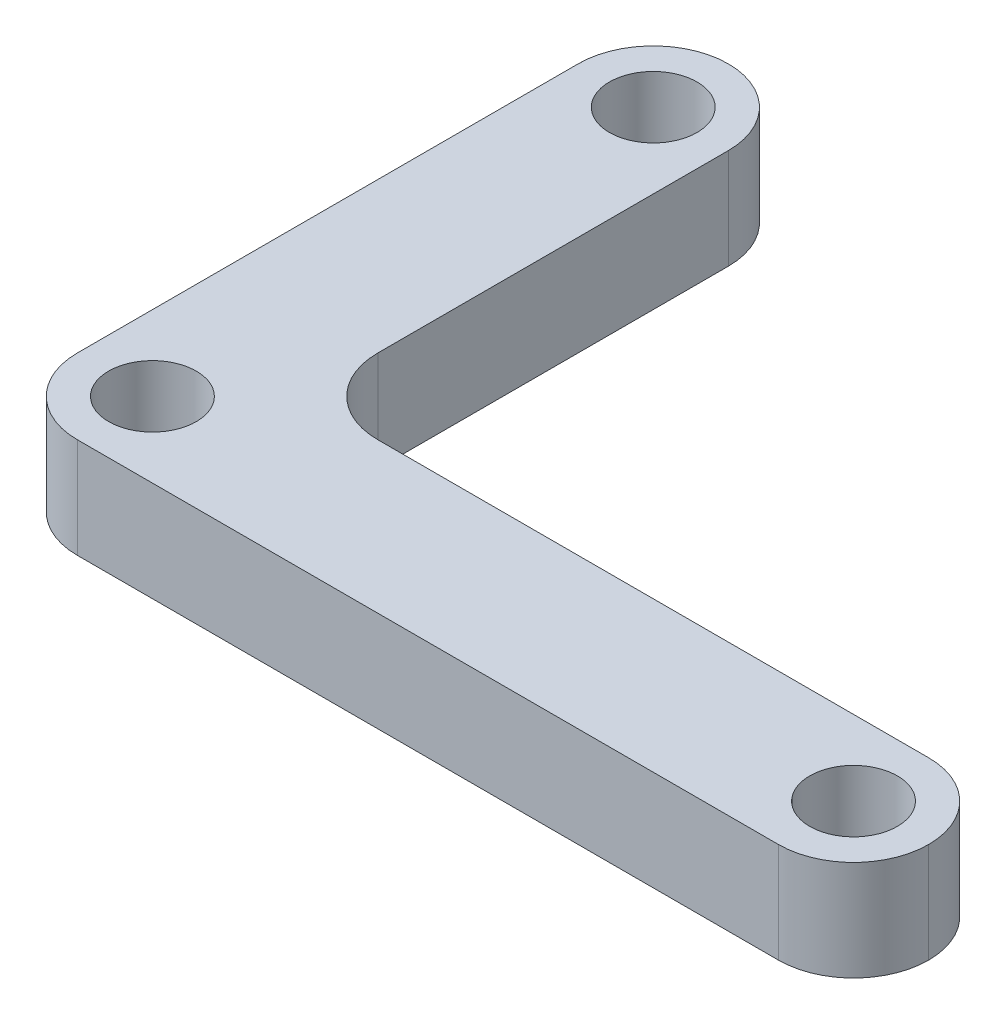
ISO-10303-21;
HEADER;
FILE_DESCRIPTION(('STEP AP214'),'2;1');
FILE_NAME('part.step','',(''),(''),'','','');
FILE_SCHEMA(('AUTOMOTIVE_DESIGN { 1 0 10303 214 1 1 1 1 }'));
ENDSEC;
DATA;
#1=APPLICATION_CONTEXT('core data for automotive mechanical design processes');
#2=APPLICATION_PROTOCOL_DEFINITION('international standard','automotive_design',2000,#1);
#3=PRODUCT_CONTEXT('',#1,'mechanical');
#4=PRODUCT('Part','Part','',(#3));
#5=PRODUCT_RELATED_PRODUCT_CATEGORY('part','',(#4));
#6=PRODUCT_DEFINITION_FORMATION('','',#4);
#7=PRODUCT_DEFINITION_CONTEXT('part definition',#1,'design');
#8=PRODUCT_DEFINITION('design','',#6,#7);
#9=PRODUCT_DEFINITION_SHAPE('','',#8);
#10=(LENGTH_UNIT() NAMED_UNIT(*) SI_UNIT(.MILLI.,.METRE.));
#11=(NAMED_UNIT(*) PLANE_ANGLE_UNIT() SI_UNIT($,.RADIAN.));
#12=(NAMED_UNIT(*) SI_UNIT($,.STERADIAN.) SOLID_ANGLE_UNIT());
#13=UNCERTAINTY_MEASURE_WITH_UNIT(LENGTH_MEASURE(1.E-05),#10,'distance_accuracy_value','');
#14=(GEOMETRIC_REPRESENTATION_CONTEXT(3) GLOBAL_UNCERTAINTY_ASSIGNED_CONTEXT((#13)) GLOBAL_UNIT_ASSIGNED_CONTEXT((#10,
#11,#12)) REPRESENTATION_CONTEXT('',''));
#15=CARTESIAN_POINT('',(0.,0.,0.));
#16=DIRECTION('',(0.,0.,1.));
#17=DIRECTION('',(1.,0.,0.));
#18=AXIS2_PLACEMENT_3D('',#15,#16,#17);
#19=CARTESIAN_POINT('',(0.,4.,0.));
#20=DIRECTION('',(0.,-1.,0.));
#21=DIRECTION('',(0.,0.,-1.));
#22=AXIS2_PLACEMENT_3D('',#19,#20,#21);
#23=PLANE('',#22);
#24=DIRECTION('',(0.,0.,1.));
#25=VECTOR('',#24,1.);
#26=CARTESIAN_POINT('',(0.,4.,0.));
#27=LINE('',#26,#25);
#28=CARTESIAN_POINT('',(0.,4.,-23.));
#29=VERTEX_POINT('',#28);
#30=CARTESIAN_POINT('',(0.,4.,-3.));
#31=VERTEX_POINT('',#30);
#32=EDGE_CURVE('E152',#29,#31,#27,.T.);
#33=ORIENTED_EDGE('',*,*,#32,.T.);
#34=CARTESIAN_POINT('',(3.,4.,-3.));
#35=DIRECTION('',(0.,-1.,0.));
#36=DIRECTION('',(0.,0.,-1.));
#37=AXIS2_PLACEMENT_3D('',#34,#35,#36);
#38=CIRCLE('',#37,3.);
#39=CARTESIAN_POINT('',(3.,4.,0.));
#40=VERTEX_POINT('',#39);
#41=EDGE_CURVE('E125',#31,#40,#38,.F.);
#42=ORIENTED_EDGE('',*,*,#41,.T.);
#43=DIRECTION('',(1.,0.,0.));
#44=VECTOR('',#43,1.);
#45=CARTESIAN_POINT('',(34.,4.,0.));
#46=LINE('',#45,#44);
#47=CARTESIAN_POINT('',(31.,4.,0.));
#48=VERTEX_POINT('',#47);
#49=EDGE_CURVE('E146',#40,#48,#46,.T.);
#50=ORIENTED_EDGE('',*,*,#49,.T.);
#51=CARTESIAN_POINT('',(31.,4.,-3.00000000000001));
#52=DIRECTION('',(0.,-1.,0.));
#53=DIRECTION('',(0.,0.,-1.));
#54=AXIS2_PLACEMENT_3D('',#51,#52,#53);
#55=CIRCLE('',#54,3.);
#56=CARTESIAN_POINT('',(34.,4.,-3.00000000000001));
#57=VERTEX_POINT('',#56);
#58=EDGE_CURVE('E61',#48,#57,#55,.F.);
#59=ORIENTED_EDGE('',*,*,#58,.T.);
#60=CARTESIAN_POINT('',(31.,4.,-3.00000000000001));
#61=DIRECTION('',(0.,-1.,0.));
#62=DIRECTION('',(0.,0.,-1.));
#63=AXIS2_PLACEMENT_3D('',#60,#61,#62);
#64=CIRCLE('',#63,3.);
#65=CARTESIAN_POINT('',(31.,4.,-6.00000000000001));
#66=VERTEX_POINT('',#65);
#67=EDGE_CURVE('E177',#57,#66,#64,.F.);
#68=ORIENTED_EDGE('',*,*,#67,.T.);
#69=DIRECTION('',(-1.,0.,0.));
#70=VECTOR('',#69,1.);
#71=CARTESIAN_POINT('',(6.,4.,-6.));
#72=LINE('',#71,#70);
#73=CARTESIAN_POINT('',(9.,4.,-6.));
#74=VERTEX_POINT('',#73);
#75=EDGE_CURVE('E211',#66,#74,#72,.T.);
#76=ORIENTED_EDGE('',*,*,#75,.T.);
#77=CARTESIAN_POINT('',(9.,4.,-9.));
#78=DIRECTION('',(0.,-1.,0.));
#79=DIRECTION('',(0.,0.,-1.));
#80=AXIS2_PLACEMENT_3D('',#77,#78,#79);
#81=CIRCLE('',#80,3.);
#82=CARTESIAN_POINT('',(6.,4.,-9.));
#83=VERTEX_POINT('',#82);
#84=EDGE_CURVE('E11',#74,#83,#81,.T.);
#85=ORIENTED_EDGE('',*,*,#84,.T.);
#86=DIRECTION('',(0.,0.,-1.));
#87=VECTOR('',#86,1.);
#88=CARTESIAN_POINT('',(6.,4.,-26.));
#89=LINE('',#88,#87);
#90=CARTESIAN_POINT('',(6.,4.,-23.));
#91=VERTEX_POINT('',#90);
#92=EDGE_CURVE('E133',#83,#91,#89,.T.);
#93=ORIENTED_EDGE('',*,*,#92,.T.);
#94=CARTESIAN_POINT('',(3.,4.,-23.));
#95=DIRECTION('',(0.,-1.,0.));
#96=DIRECTION('',(0.,0.,-1.));
#97=AXIS2_PLACEMENT_3D('',#94,#95,#96);
#98=CIRCLE('',#97,3.);
#99=CARTESIAN_POINT('',(2.99999999999999,4.,-26.));
#100=VERTEX_POINT('',#99);
#101=EDGE_CURVE('E54',#91,#100,#98,.F.);
#102=ORIENTED_EDGE('',*,*,#101,.T.);
#103=CARTESIAN_POINT('',(3.,4.,-23.));
#104=DIRECTION('',(0.,-1.,0.));
#105=DIRECTION('',(0.,0.,-1.));
#106=AXIS2_PLACEMENT_3D('',#103,#104,#105);
#107=CIRCLE('',#106,3.);
#108=EDGE_CURVE('E180',#100,#29,#107,.F.);
#109=ORIENTED_EDGE('',*,*,#108,.T.);
#110=EDGE_LOOP('',(#33,#42,#50,#59,#68,#76,#85,#93,#102,#109));
#111=FACE_BOUND('',#110,.T.);
#112=CARTESIAN_POINT('',(3.,4.,-23.));
#113=DIRECTION('',(0.,1.,0.));
#114=DIRECTION('',(0.,0.,1.));
#115=AXIS2_PLACEMENT_3D('',#112,#113,#114);
#116=CIRCLE('',#115,1.75);
#117=CARTESIAN_POINT('',(3.,4.,-21.25));
#118=VERTEX_POINT('',#117);
#119=EDGE_CURVE('E203',#118,#118,#116,.T.);
#120=ORIENTED_EDGE('',*,*,#119,.F.);
#121=EDGE_LOOP('',(#120));
#122=FACE_BOUND('',#121,.T.);
#123=CARTESIAN_POINT('',(31.,4.,-3.00000000000001));
#124=DIRECTION('',(0.,1.,0.));
#125=DIRECTION('',(0.,0.,1.));
#126=AXIS2_PLACEMENT_3D('',#123,#124,#125);
#127=CIRCLE('',#126,1.75000000000001);
#128=CARTESIAN_POINT('',(31.,4.,-1.25));
#129=VERTEX_POINT('',#128);
#130=EDGE_CURVE('E216',#129,#129,#127,.T.);
#131=ORIENTED_EDGE('',*,*,#130,.F.);
#132=EDGE_LOOP('',(#131));
#133=FACE_BOUND('',#132,.T.);
#134=CARTESIAN_POINT('',(3.,4.,-3.));
#135=DIRECTION('',(0.,1.,0.));
#136=DIRECTION('',(0.,0.,1.));
#137=AXIS2_PLACEMENT_3D('',#134,#135,#136);
#138=CIRCLE('',#137,1.75);
#139=CARTESIAN_POINT('',(3.,4.,-1.25));
#140=VERTEX_POINT('',#139);
#141=EDGE_CURVE('E188',#140,#140,#138,.T.);
#142=ORIENTED_EDGE('',*,*,#141,.F.);
#143=EDGE_LOOP('',(#142));
#144=FACE_BOUND('',#143,.T.);
#145=ADVANCED_FACE('F37',(#111,#122,#133,#144),#23,.F.);
#146=CARTESIAN_POINT('',(0.,0.,0.));
#147=DIRECTION('',(0.,-1.,0.));
#148=DIRECTION('',(0.,0.,-1.));
#149=AXIS2_PLACEMENT_3D('',#146,#147,#148);
#150=PLANE('',#149);
#151=CARTESIAN_POINT('',(31.,0.,-3.00000000000001));
#152=DIRECTION('',(0.,1.,0.));
#153=DIRECTION('',(0.,0.,1.));
#154=AXIS2_PLACEMENT_3D('',#151,#152,#153);
#155=CIRCLE('',#154,1.75000000000001);
#156=CARTESIAN_POINT('',(31.,0.,-1.25));
#157=VERTEX_POINT('',#156);
#158=EDGE_CURVE('E218',#157,#157,#155,.T.);
#159=ORIENTED_EDGE('',*,*,#158,.T.);
#160=EDGE_LOOP('',(#159));
#161=FACE_BOUND('',#160,.T.);
#162=DIRECTION('',(1.,0.,0.));
#163=VECTOR('',#162,1.);
#164=CARTESIAN_POINT('',(34.,0.,0.));
#165=LINE('',#164,#163);
#166=CARTESIAN_POINT('',(3.,0.,0.));
#167=VERTEX_POINT('',#166);
#168=CARTESIAN_POINT('',(31.,0.,0.));
#169=VERTEX_POINT('',#168);
#170=EDGE_CURVE('E148',#167,#169,#165,.T.);
#171=ORIENTED_EDGE('',*,*,#170,.F.);
#172=CARTESIAN_POINT('',(3.,0.,-3.));
#173=DIRECTION('',(0.,-1.,0.));
#174=DIRECTION('',(0.,0.,-1.));
#175=AXIS2_PLACEMENT_3D('',#172,#173,#174);
#176=CIRCLE('',#175,3.);
#177=CARTESIAN_POINT('',(0.,0.,-3.));
#178=VERTEX_POINT('',#177);
#179=EDGE_CURVE('E169',#167,#178,#176,.T.);
#180=ORIENTED_EDGE('',*,*,#179,.T.);
#181=DIRECTION('',(0.,0.,1.));
#182=VECTOR('',#181,1.);
#183=CARTESIAN_POINT('',(0.,0.,0.));
#184=LINE('',#183,#182);
#185=CARTESIAN_POINT('',(0.,0.,-23.));
#186=VERTEX_POINT('',#185);
#187=EDGE_CURVE('E142',#186,#178,#184,.T.);
#188=ORIENTED_EDGE('',*,*,#187,.F.);
#189=CARTESIAN_POINT('',(3.,0.,-23.));
#190=DIRECTION('',(0.,-1.,0.));
#191=DIRECTION('',(0.,0.,-1.));
#192=AXIS2_PLACEMENT_3D('',#189,#190,#191);
#193=CIRCLE('',#192,3.);
#194=CARTESIAN_POINT('',(2.99999999999999,0.,-26.));
#195=VERTEX_POINT('',#194);
#196=EDGE_CURVE('E167',#186,#195,#193,.T.);
#197=ORIENTED_EDGE('',*,*,#196,.T.);
#198=CARTESIAN_POINT('',(3.,0.,-23.));
#199=DIRECTION('',(0.,-1.,0.));
#200=DIRECTION('',(0.,0.,-1.));
#201=AXIS2_PLACEMENT_3D('',#198,#199,#200);
#202=CIRCLE('',#201,3.);
#203=CARTESIAN_POINT('',(6.,0.,-23.));
#204=VERTEX_POINT('',#203);
#205=EDGE_CURVE('E141',#195,#204,#202,.T.);
#206=ORIENTED_EDGE('',*,*,#205,.T.);
#207=DIRECTION('',(0.,0.,-1.));
#208=VECTOR('',#207,1.);
#209=CARTESIAN_POINT('',(6.,0.,-26.));
#210=LINE('',#209,#208);
#211=CARTESIAN_POINT('',(6.,0.,-9.));
#212=VERTEX_POINT('',#211);
#213=EDGE_CURVE('E131',#212,#204,#210,.T.);
#214=ORIENTED_EDGE('',*,*,#213,.F.);
#215=CARTESIAN_POINT('',(9.,0.,-9.));
#216=DIRECTION('',(0.,-1.,0.));
#217=DIRECTION('',(0.,0.,-1.));
#218=AXIS2_PLACEMENT_3D('',#215,#216,#217);
#219=CIRCLE('',#218,3.);
#220=CARTESIAN_POINT('',(9.,0.,-6.));
#221=VERTEX_POINT('',#220);
#222=EDGE_CURVE('E46',#212,#221,#219,.F.);
#223=ORIENTED_EDGE('',*,*,#222,.T.);
#224=DIRECTION('',(-1.,0.,0.));
#225=VECTOR('',#224,1.);
#226=CARTESIAN_POINT('',(6.,0.,-6.));
#227=LINE('',#226,#225);
#228=CARTESIAN_POINT('',(31.,0.,-6.00000000000001));
#229=VERTEX_POINT('',#228);
#230=EDGE_CURVE('E143',#229,#221,#227,.T.);
#231=ORIENTED_EDGE('',*,*,#230,.F.);
#232=CARTESIAN_POINT('',(31.,0.,-3.00000000000001));
#233=DIRECTION('',(0.,-1.,0.));
#234=DIRECTION('',(0.,0.,-1.));
#235=AXIS2_PLACEMENT_3D('',#232,#233,#234);
#236=CIRCLE('',#235,3.);
#237=CARTESIAN_POINT('',(34.,0.,-3.00000000000001));
#238=VERTEX_POINT('',#237);
#239=EDGE_CURVE('E164',#229,#238,#236,.T.);
#240=ORIENTED_EDGE('',*,*,#239,.T.);
#241=CARTESIAN_POINT('',(31.,0.,-3.00000000000001));
#242=DIRECTION('',(0.,-1.,0.));
#243=DIRECTION('',(0.,0.,-1.));
#244=AXIS2_PLACEMENT_3D('',#241,#242,#243);
#245=CIRCLE('',#244,3.);
#246=EDGE_CURVE('E162',#238,#169,#245,.T.);
#247=ORIENTED_EDGE('',*,*,#246,.T.);
#248=EDGE_LOOP('',(#171,#180,#188,#197,#206,#214,#223,#231,#240,#247));
#249=FACE_BOUND('',#248,.T.);
#250=CARTESIAN_POINT('',(3.,0.,-23.));
#251=DIRECTION('',(0.,1.,0.));
#252=DIRECTION('',(0.,0.,1.));
#253=AXIS2_PLACEMENT_3D('',#250,#251,#252);
#254=CIRCLE('',#253,1.75);
#255=CARTESIAN_POINT('',(3.,0.,-21.25));
#256=VERTEX_POINT('',#255);
#257=EDGE_CURVE('E205',#256,#256,#254,.T.);
#258=ORIENTED_EDGE('',*,*,#257,.T.);
#259=EDGE_LOOP('',(#258));
#260=FACE_BOUND('',#259,.T.);
#261=CARTESIAN_POINT('',(3.,0.,-3.));
#262=DIRECTION('',(0.,1.,0.));
#263=DIRECTION('',(0.,0.,1.));
#264=AXIS2_PLACEMENT_3D('',#261,#262,#263);
#265=CIRCLE('',#264,1.75);
#266=CARTESIAN_POINT('',(3.,0.,-1.25));
#267=VERTEX_POINT('',#266);
#268=EDGE_CURVE('E184',#267,#267,#265,.T.);
#269=ORIENTED_EDGE('',*,*,#268,.T.);
#270=EDGE_LOOP('',(#269));
#271=FACE_BOUND('',#270,.T.);
#272=ADVANCED_FACE('F138',(#161,#249,#260,#271),#150,.T.);
#273=CARTESIAN_POINT('',(34.,4.,0.));
#274=DIRECTION('',(0.,0.,-1.));
#275=DIRECTION('',(-1.,0.,0.));
#276=AXIS2_PLACEMENT_3D('',#273,#274,#275);
#277=PLANE('',#276);
#278=ORIENTED_EDGE('',*,*,#49,.F.);
#279=DIRECTION('',(0.,-1.,0.));
#280=VECTOR('',#279,1.);
#281=CARTESIAN_POINT('',(3.,4.,0.));
#282=LINE('',#281,#280);
#283=EDGE_CURVE('E159',#40,#167,#282,.T.);
#284=ORIENTED_EDGE('',*,*,#283,.T.);
#285=ORIENTED_EDGE('',*,*,#170,.T.);
#286=DIRECTION('',(0.,-1.,0.));
#287=VECTOR('',#286,1.);
#288=CARTESIAN_POINT('',(31.,4.,0.));
#289=LINE('',#288,#287);
#290=EDGE_CURVE('E157',#169,#48,#289,.F.);
#291=ORIENTED_EDGE('',*,*,#290,.T.);
#292=EDGE_LOOP('',(#278,#284,#285,#291));
#293=FACE_BOUND('',#292,.T.);
#294=ADVANCED_FACE('F201',(#293),#277,.F.);
#295=CARTESIAN_POINT('',(6.,4.,-6.));
#296=DIRECTION('',(0.,0.,1.));
#297=DIRECTION('',(1.,0.,0.));
#298=AXIS2_PLACEMENT_3D('',#295,#296,#297);
#299=PLANE('',#298);
#300=ORIENTED_EDGE('',*,*,#230,.T.);
#301=DIRECTION('',(0.,-1.,0.));
#302=VECTOR('',#301,1.);
#303=CARTESIAN_POINT('',(9.,4.,-6.));
#304=LINE('',#303,#302);
#305=EDGE_CURVE('E120',#221,#74,#304,.F.);
#306=ORIENTED_EDGE('',*,*,#305,.T.);
#307=ORIENTED_EDGE('',*,*,#75,.F.);
#308=DIRECTION('',(0.,-1.,0.));
#309=VECTOR('',#308,1.);
#310=CARTESIAN_POINT('',(31.,4.,-6.00000000000001));
#311=LINE('',#310,#309);
#312=EDGE_CURVE('E134',#66,#229,#311,.T.);
#313=ORIENTED_EDGE('',*,*,#312,.T.);
#314=EDGE_LOOP('',(#300,#306,#307,#313));
#315=FACE_BOUND('',#314,.T.);
#316=ADVANCED_FACE('F247',(#315),#299,.F.);
#317=CARTESIAN_POINT('',(6.,4.,-26.));
#318=DIRECTION('',(-1.,0.,0.));
#319=DIRECTION('',(0.,0.,1.));
#320=AXIS2_PLACEMENT_3D('',#317,#318,#319);
#321=PLANE('',#320);
#322=ORIENTED_EDGE('',*,*,#92,.F.);
#323=DIRECTION('',(0.,-1.,0.));
#324=VECTOR('',#323,1.);
#325=CARTESIAN_POINT('',(6.,0.,-9.));
#326=LINE('',#325,#324);
#327=EDGE_CURVE('E119',#83,#212,#326,.T.);
#328=ORIENTED_EDGE('',*,*,#327,.T.);
#329=ORIENTED_EDGE('',*,*,#213,.T.);
#330=DIRECTION('',(0.,-1.,0.));
#331=VECTOR('',#330,1.);
#332=CARTESIAN_POINT('',(6.,4.,-23.));
#333=LINE('',#332,#331);
#334=EDGE_CURVE('E135',#204,#91,#333,.F.);
#335=ORIENTED_EDGE('',*,*,#334,.T.);
#336=EDGE_LOOP('',(#322,#328,#329,#335));
#337=FACE_BOUND('',#336,.T.);
#338=ADVANCED_FACE('F130',(#337),#321,.F.);
#339=CARTESIAN_POINT('',(0.,4.,0.));
#340=DIRECTION('',(1.,0.,0.));
#341=DIRECTION('',(0.,0.,-1.));
#342=AXIS2_PLACEMENT_3D('',#339,#340,#341);
#343=PLANE('',#342);
#344=ORIENTED_EDGE('',*,*,#187,.T.);
#345=DIRECTION('',(0.,-1.,0.));
#346=VECTOR('',#345,1.);
#347=CARTESIAN_POINT('',(0.,4.,-3.));
#348=LINE('',#347,#346);
#349=EDGE_CURVE('E174',#178,#31,#348,.F.);
#350=ORIENTED_EDGE('',*,*,#349,.T.);
#351=ORIENTED_EDGE('',*,*,#32,.F.);
#352=DIRECTION('',(0.,-1.,0.));
#353=VECTOR('',#352,1.);
#354=CARTESIAN_POINT('',(0.,4.,-23.));
#355=LINE('',#354,#353);
#356=EDGE_CURVE('E171',#29,#186,#355,.T.);
#357=ORIENTED_EDGE('',*,*,#356,.T.);
#358=EDGE_LOOP('',(#344,#350,#351,#357));
#359=FACE_BOUND('',#358,.T.);
#360=ADVANCED_FACE('F241',(#359),#343,.F.);
#361=CARTESIAN_POINT('',(3.,4.,-23.));
#362=DIRECTION('',(0.,-1.,0.));
#363=DIRECTION('',(0.,0.,-1.));
#364=AXIS2_PLACEMENT_3D('',#361,#362,#363);
#365=CYLINDRICAL_SURFACE('',#364,1.75);
#366=ORIENTED_EDGE('',*,*,#119,.T.);
#367=EDGE_LOOP('',(#366));
#368=FACE_BOUND('',#367,.T.);
#369=ORIENTED_EDGE('',*,*,#257,.F.);
#370=EDGE_LOOP('',(#369));
#371=FACE_BOUND('',#370,.T.);
#372=ADVANCED_FACE('F238',(#368,#371),#365,.F.);
#373=CARTESIAN_POINT('',(31.,4.,-3.00000000000001));
#374=DIRECTION('',(0.,-1.,0.));
#375=DIRECTION('',(0.,0.,-1.));
#376=AXIS2_PLACEMENT_3D('',#373,#374,#375);
#377=CYLINDRICAL_SURFACE('',#376,1.75000000000001);
#378=ORIENTED_EDGE('',*,*,#130,.T.);
#379=EDGE_LOOP('',(#378));
#380=FACE_BOUND('',#379,.T.);
#381=ORIENTED_EDGE('',*,*,#158,.F.);
#382=EDGE_LOOP('',(#381));
#383=FACE_BOUND('',#382,.T.);
#384=ADVANCED_FACE('F294',(#380,#383),#377,.F.);
#385=CARTESIAN_POINT('',(3.,4.,-3.));
#386=DIRECTION('',(0.,-1.,0.));
#387=DIRECTION('',(0.,0.,-1.));
#388=AXIS2_PLACEMENT_3D('',#385,#386,#387);
#389=CYLINDRICAL_SURFACE('',#388,1.75);
#390=ORIENTED_EDGE('',*,*,#141,.T.);
#391=EDGE_LOOP('',(#390));
#392=FACE_BOUND('',#391,.T.);
#393=ORIENTED_EDGE('',*,*,#268,.F.);
#394=EDGE_LOOP('',(#393));
#395=FACE_BOUND('',#394,.T.);
#396=ADVANCED_FACE('F226',(#392,#395),#389,.F.);
#397=CARTESIAN_POINT('',(9.,4.,-9.));
#398=DIRECTION('',(0.,1.,0.));
#399=DIRECTION('',(0.,0.,1.));
#400=AXIS2_PLACEMENT_3D('',#397,#398,#399);
#401=CYLINDRICAL_SURFACE('',#400,3.);
#402=ORIENTED_EDGE('',*,*,#84,.F.);
#403=ORIENTED_EDGE('',*,*,#305,.F.);
#404=ORIENTED_EDGE('',*,*,#222,.F.);
#405=ORIENTED_EDGE('',*,*,#327,.F.);
#406=EDGE_LOOP('',(#402,#403,#404,#405));
#407=FACE_BOUND('',#406,.T.);
#408=ADVANCED_FACE('F118',(#407),#401,.F.);
#409=CARTESIAN_POINT('',(3.,4.,-3.));
#410=DIRECTION('',(0.,-1.,0.));
#411=DIRECTION('',(0.,0.,-1.));
#412=AXIS2_PLACEMENT_3D('',#409,#410,#411);
#413=CYLINDRICAL_SURFACE('',#412,3.);
#414=ORIENTED_EDGE('',*,*,#41,.F.);
#415=ORIENTED_EDGE('',*,*,#349,.F.);
#416=ORIENTED_EDGE('',*,*,#179,.F.);
#417=ORIENTED_EDGE('',*,*,#283,.F.);
#418=EDGE_LOOP('',(#414,#415,#416,#417));
#419=FACE_BOUND('',#418,.T.);
#420=ADVANCED_FACE('F255',(#419),#413,.T.);
#421=CARTESIAN_POINT('',(3.,4.,-23.));
#422=DIRECTION('',(0.,-1.,0.));
#423=DIRECTION('',(0.,0.,-1.));
#424=AXIS2_PLACEMENT_3D('',#421,#422,#423);
#425=CYLINDRICAL_SURFACE('',#424,3.);
#426=DIRECTION('',(0.,-1.,0.));
#427=VECTOR('',#426,1.);
#428=CARTESIAN_POINT('',(2.99999999999999,4.,-26.));
#429=LINE('',#428,#427);
#430=EDGE_CURVE('E182',#100,#195,#429,.T.);
#431=ORIENTED_EDGE('',*,*,#430,.F.);
#432=ORIENTED_EDGE('',*,*,#101,.F.);
#433=ORIENTED_EDGE('',*,*,#334,.F.);
#434=ORIENTED_EDGE('',*,*,#205,.F.);
#435=EDGE_LOOP('',(#431,#432,#433,#434));
#436=FACE_BOUND('',#435,.T.);
#437=ADVANCED_FACE('F258',(#436),#425,.T.);
#438=CARTESIAN_POINT('',(3.,4.,-23.));
#439=DIRECTION('',(0.,-1.,0.));
#440=DIRECTION('',(0.,0.,-1.));
#441=AXIS2_PLACEMENT_3D('',#438,#439,#440);
#442=CYLINDRICAL_SURFACE('',#441,3.);
#443=ORIENTED_EDGE('',*,*,#108,.F.);
#444=ORIENTED_EDGE('',*,*,#430,.T.);
#445=ORIENTED_EDGE('',*,*,#196,.F.);
#446=ORIENTED_EDGE('',*,*,#356,.F.);
#447=EDGE_LOOP('',(#443,#444,#445,#446));
#448=FACE_BOUND('',#447,.T.);
#449=ADVANCED_FACE('F260',(#448),#442,.T.);
#450=CARTESIAN_POINT('',(31.,4.,-3.00000000000001));
#451=DIRECTION('',(0.,-1.,0.));
#452=DIRECTION('',(0.,0.,-1.));
#453=AXIS2_PLACEMENT_3D('',#450,#451,#452);
#454=CYLINDRICAL_SURFACE('',#453,3.);
#455=DIRECTION('',(0.,-1.,0.));
#456=VECTOR('',#455,1.);
#457=CARTESIAN_POINT('',(34.,4.,-3.00000000000001));
#458=LINE('',#457,#456);
#459=EDGE_CURVE('E41',#57,#238,#458,.T.);
#460=ORIENTED_EDGE('',*,*,#459,.F.);
#461=ORIENTED_EDGE('',*,*,#58,.F.);
#462=ORIENTED_EDGE('',*,*,#290,.F.);
#463=ORIENTED_EDGE('',*,*,#246,.F.);
#464=EDGE_LOOP('',(#460,#461,#462,#463));
#465=FACE_BOUND('',#464,.T.);
#466=ADVANCED_FACE('F39',(#465),#454,.T.);
#467=CARTESIAN_POINT('',(31.,4.,-3.00000000000001));
#468=DIRECTION('',(0.,-1.,0.));
#469=DIRECTION('',(0.,0.,-1.));
#470=AXIS2_PLACEMENT_3D('',#467,#468,#469);
#471=CYLINDRICAL_SURFACE('',#470,3.);
#472=ORIENTED_EDGE('',*,*,#67,.F.);
#473=ORIENTED_EDGE('',*,*,#459,.T.);
#474=ORIENTED_EDGE('',*,*,#239,.F.);
#475=ORIENTED_EDGE('',*,*,#312,.F.);
#476=EDGE_LOOP('',(#472,#473,#474,#475));
#477=FACE_BOUND('',#476,.T.);
#478=ADVANCED_FACE('F193',(#477),#471,.T.);
#479=CLOSED_SHELL('',(#145,#272,#294,#316,#338,#360,#372,#384,#396,#408,#420,#437,#449,#466,#478));
#480=MANIFOLD_SOLID_BREP('B2',#479);
#481=ADVANCED_BREP_SHAPE_REPRESENTATION('',(#18,#480),#14);
#482=SHAPE_DEFINITION_REPRESENTATION(#9,#481);
ENDSEC;
END-ISO-10303-21;
